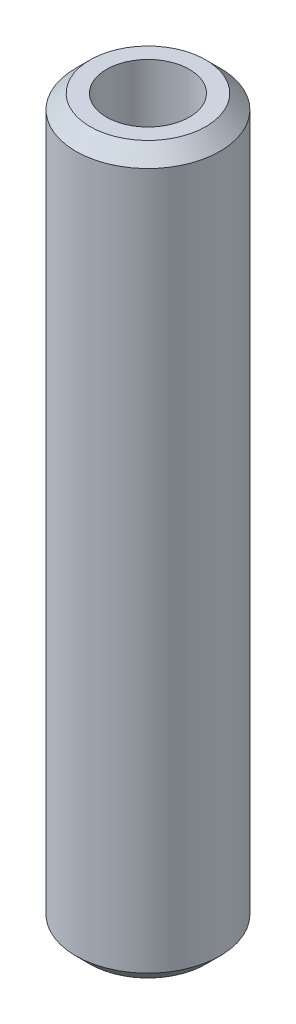
ISO-10303-21;
HEADER;
FILE_DESCRIPTION(('STEP AP214'),'2;1');
FILE_NAME('part.step','',(''),(''),'','','');
FILE_SCHEMA(('AUTOMOTIVE_DESIGN { 1 0 10303 214 1 1 1 1 }'));
ENDSEC;
DATA;
#1=APPLICATION_CONTEXT('core data for automotive mechanical design processes');
#2=APPLICATION_PROTOCOL_DEFINITION('international standard','automotive_design',2000,#1);
#3=PRODUCT_CONTEXT('',#1,'mechanical');
#4=PRODUCT('Part','Part','',(#3));
#5=PRODUCT_RELATED_PRODUCT_CATEGORY('part','',(#4));
#6=PRODUCT_DEFINITION_FORMATION('','',#4);
#7=PRODUCT_DEFINITION_CONTEXT('part definition',#1,'design');
#8=PRODUCT_DEFINITION('design','',#6,#7);
#9=PRODUCT_DEFINITION_SHAPE('','',#8);
#10=(LENGTH_UNIT() NAMED_UNIT(*) SI_UNIT(.MILLI.,.METRE.));
#11=(NAMED_UNIT(*) PLANE_ANGLE_UNIT() SI_UNIT($,.RADIAN.));
#12=(NAMED_UNIT(*) SI_UNIT($,.STERADIAN.) SOLID_ANGLE_UNIT());
#13=UNCERTAINTY_MEASURE_WITH_UNIT(LENGTH_MEASURE(1.E-05),#10,'distance_accuracy_value','');
#14=(GEOMETRIC_REPRESENTATION_CONTEXT(3) GLOBAL_UNCERTAINTY_ASSIGNED_CONTEXT((#13)) GLOBAL_UNIT_ASSIGNED_CONTEXT((#10,
#11,#12)) REPRESENTATION_CONTEXT('',''));
#15=CARTESIAN_POINT('',(0.,0.,0.));
#16=DIRECTION('',(0.,0.,1.));
#17=DIRECTION('',(1.,0.,0.));
#18=AXIS2_PLACEMENT_3D('',#15,#16,#17);
#19=CARTESIAN_POINT('',(0.,226.309533306805,0.));
#20=DIRECTION('',(0.,-1.,0.));
#21=DIRECTION('',(0.,0.,-1.));
#22=AXIS2_PLACEMENT_3D('',#19,#20,#21);
#23=CYLINDRICAL_SURFACE('',#22,22.5);
#24=CARTESIAN_POINT('',(0.,221.860596117062,0.));
#25=DIRECTION('',(0.,1.,0.));
#26=DIRECTION('',(0.,0.,1.));
#27=AXIS2_PLACEMENT_3D('',#24,#25,#26);
#28=CIRCLE('',#27,22.5);
#29=CARTESIAN_POINT('',(0.,221.860596117062,22.5));
#30=VERTEX_POINT('',#29);
#31=EDGE_CURVE('E50',#30,#30,#28,.F.);
#32=ORIENTED_EDGE('',*,*,#31,.T.);
#33=EDGE_LOOP('',(#32));
#34=FACE_BOUND('',#33,.T.);
#35=CARTESIAN_POINT('',(0.,4.4489371897429,0.));
#36=DIRECTION('',(0.,1.,0.));
#37=DIRECTION('',(0.,0.,1.));
#38=AXIS2_PLACEMENT_3D('',#35,#36,#37);
#39=CIRCLE('',#38,22.5);
#40=CARTESIAN_POINT('',(0.,4.4489371897429,22.5));
#41=VERTEX_POINT('',#40);
#42=EDGE_CURVE('E51',#41,#41,#39,.T.);
#43=ORIENTED_EDGE('',*,*,#42,.T.);
#44=EDGE_LOOP('',(#43));
#45=FACE_BOUND('',#44,.T.);
#46=ADVANCED_FACE('F39',(#34,#45),#23,.T.);
#47=CARTESIAN_POINT('',(0.,226.309533306805,0.));
#48=DIRECTION('',(0.,1.,0.));
#49=DIRECTION('',(0.,0.,1.));
#50=AXIS2_PLACEMENT_3D('',#47,#48,#49);
#51=PLANE('',#50);
#52=CARTESIAN_POINT('',(0.,226.309533306805,0.));
#53=DIRECTION('',(0.,1.,0.));
#54=DIRECTION('',(0.,0.,1.));
#55=AXIS2_PLACEMENT_3D('',#52,#53,#54);
#56=CIRCLE('',#55,18.0510628102571);
#57=CARTESIAN_POINT('',(0.,226.309533306805,18.0510628102571));
#58=VERTEX_POINT('',#57);
#59=EDGE_CURVE('E54',#58,#58,#56,.T.);
#60=ORIENTED_EDGE('',*,*,#59,.T.);
#61=EDGE_LOOP('',(#60));
#62=FACE_BOUND('',#61,.T.);
#63=CARTESIAN_POINT('',(0.,226.309533306805,0.));
#64=DIRECTION('',(0.,1.,0.));
#65=DIRECTION('',(0.,0.,1.));
#66=AXIS2_PLACEMENT_3D('',#63,#64,#65);
#67=CIRCLE('',#66,12.9210955076874);
#68=CARTESIAN_POINT('',(0.,226.309533306805,12.9210955076874));
#69=VERTEX_POINT('',#68);
#70=EDGE_CURVE('E58',#69,#69,#67,.T.);
#71=ORIENTED_EDGE('',*,*,#70,.F.);
#72=EDGE_LOOP('',(#71));
#73=FACE_BOUND('',#72,.T.);
#74=ADVANCED_FACE('F69',(#62,#73),#51,.T.);
#75=CARTESIAN_POINT('',(0.,0.,0.));
#76=DIRECTION('',(0.,1.,0.));
#77=DIRECTION('',(0.,0.,1.));
#78=AXIS2_PLACEMENT_3D('',#75,#76,#77);
#79=PLANE('',#78);
#80=CARTESIAN_POINT('',(0.,0.,0.));
#81=DIRECTION('',(0.,1.,0.));
#82=DIRECTION('',(0.,0.,1.));
#83=AXIS2_PLACEMENT_3D('',#80,#81,#82);
#84=CIRCLE('',#83,18.0510628102571);
#85=CARTESIAN_POINT('',(0.,0.,18.0510628102571));
#86=VERTEX_POINT('',#85);
#87=EDGE_CURVE('E10',#86,#86,#84,.F.);
#88=ORIENTED_EDGE('',*,*,#87,.T.);
#89=EDGE_LOOP('',(#88));
#90=FACE_BOUND('',#89,.T.);
#91=CARTESIAN_POINT('',(0.,0.,0.));
#92=DIRECTION('',(0.,1.,0.));
#93=DIRECTION('',(0.,0.,1.));
#94=AXIS2_PLACEMENT_3D('',#91,#92,#93);
#95=CIRCLE('',#94,12.9210955076874);
#96=CARTESIAN_POINT('',(0.,0.,12.9210955076874));
#97=VERTEX_POINT('',#96);
#98=EDGE_CURVE('E63',#97,#97,#95,.T.);
#99=ORIENTED_EDGE('',*,*,#98,.T.);
#100=EDGE_LOOP('',(#99));
#101=FACE_BOUND('',#100,.T.);
#102=ADVANCED_FACE('F75',(#90,#101),#79,.F.);
#103=CARTESIAN_POINT('',(0.,226.309533306805,0.));
#104=DIRECTION('',(0.,-1.,0.));
#105=DIRECTION('',(0.,0.,-1.));
#106=AXIS2_PLACEMENT_3D('',#103,#104,#105);
#107=CYLINDRICAL_SURFACE('',#106,12.9210955076874);
#108=ORIENTED_EDGE('',*,*,#70,.T.);
#109=EDGE_LOOP('',(#108));
#110=FACE_BOUND('',#109,.T.);
#111=ORIENTED_EDGE('',*,*,#98,.F.);
#112=EDGE_LOOP('',(#111));
#113=FACE_BOUND('',#112,.T.);
#114=ADVANCED_FACE('F70',(#110,#113),#107,.F.);
#115=CARTESIAN_POINT('',(0.,226.309533306805,0.));
#116=DIRECTION('',(0.,-1.,0.));
#117=DIRECTION('',(0.,0.,-1.));
#118=AXIS2_PLACEMENT_3D('',#115,#116,#117);
#119=CONICAL_SURFACE('',#118,18.0510628102571,0.785398163397441);
#120=ORIENTED_EDGE('',*,*,#31,.F.);
#121=EDGE_LOOP('',(#120));
#122=FACE_BOUND('',#121,.T.);
#123=ORIENTED_EDGE('',*,*,#59,.F.);
#124=EDGE_LOOP('',(#123));
#125=FACE_BOUND('',#124,.T.);
#126=ADVANCED_FACE('F81',(#122,#125),#119,.T.);
#127=CARTESIAN_POINT('',(0.,4.4489371897429,0.));
#128=DIRECTION('',(0.,1.,0.));
#129=DIRECTION('',(0.,0.,1.));
#130=AXIS2_PLACEMENT_3D('',#127,#128,#129);
#131=CONICAL_SURFACE('',#130,22.5,0.785398163397453);
#132=ORIENTED_EDGE('',*,*,#87,.F.);
#133=EDGE_LOOP('',(#132));
#134=FACE_BOUND('',#133,.T.);
#135=ORIENTED_EDGE('',*,*,#42,.F.);
#136=EDGE_LOOP('',(#135));
#137=FACE_BOUND('',#136,.T.);
#138=ADVANCED_FACE('F45',(#134,#137),#131,.T.);
#139=CLOSED_SHELL('',(#46,#74,#102,#114,#126,#138));
#140=MANIFOLD_SOLID_BREP('B2',#139);
#141=ADVANCED_BREP_SHAPE_REPRESENTATION('',(#18,#140),#14);
#142=SHAPE_DEFINITION_REPRESENTATION(#9,#141);
ENDSEC;
END-ISO-10303-21;
